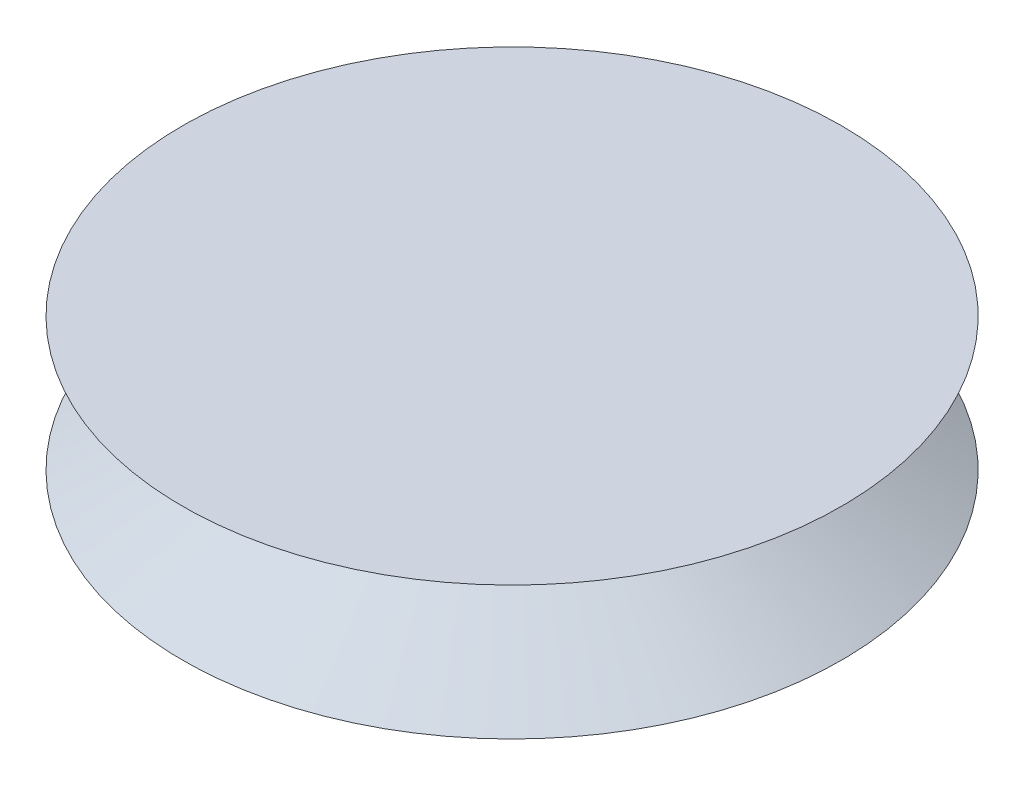
ISO-10303-21;
HEADER;
FILE_DESCRIPTION(('STEP AP214'),'2;1');
FILE_NAME('part.step','',(''),(''),'','','');
FILE_SCHEMA(('AUTOMOTIVE_DESIGN { 1 0 10303 214 1 1 1 1 }'));
ENDSEC;
DATA;
#1=APPLICATION_CONTEXT('core data for automotive mechanical design processes');
#2=APPLICATION_PROTOCOL_DEFINITION('international standard','automotive_design',2000,#1);
#3=PRODUCT_CONTEXT('',#1,'mechanical');
#4=PRODUCT('Part','Part','',(#3));
#5=PRODUCT_RELATED_PRODUCT_CATEGORY('part','',(#4));
#6=PRODUCT_DEFINITION_FORMATION('','',#4);
#7=PRODUCT_DEFINITION_CONTEXT('part definition',#1,'design');
#8=PRODUCT_DEFINITION('design','',#6,#7);
#9=PRODUCT_DEFINITION_SHAPE('','',#8);
#10=(LENGTH_UNIT() NAMED_UNIT(*) SI_UNIT(.MILLI.,.METRE.));
#11=(NAMED_UNIT(*) PLANE_ANGLE_UNIT() SI_UNIT($,.RADIAN.));
#12=(NAMED_UNIT(*) SI_UNIT($,.STERADIAN.) SOLID_ANGLE_UNIT());
#13=UNCERTAINTY_MEASURE_WITH_UNIT(LENGTH_MEASURE(1.E-05),#10,'distance_accuracy_value','');
#14=(GEOMETRIC_REPRESENTATION_CONTEXT(3) GLOBAL_UNCERTAINTY_ASSIGNED_CONTEXT((#13)) GLOBAL_UNIT_ASSIGNED_CONTEXT((#10,
#11,#12)) REPRESENTATION_CONTEXT('',''));
#15=CARTESIAN_POINT('',(0.,0.,0.));
#16=DIRECTION('',(0.,0.,1.));
#17=DIRECTION('',(1.,0.,0.));
#18=AXIS2_PLACEMENT_3D('',#15,#16,#17);
#19=CARTESIAN_POINT('',(-68.9357898147831,63.2017306856585,0.));
#20=DIRECTION('',(0.,-1.,0.));
#21=DIRECTION('',(0.,0.,-1.));
#22=AXIS2_PLACEMENT_3D('',#19,#20,#21);
#23=CONICAL_SURFACE('',#22,38.2092999291395,1.03158309855684);
#24=CARTESIAN_POINT('',(-68.9357898147831,48.6742364417669,0.));
#25=DIRECTION('',(0.,-1.,0.));
#26=DIRECTION('',(0.,0.,-1.));
#27=AXIS2_PLACEMENT_3D('',#24,#25,#26);
#28=CIRCLE('',#27,62.4881259257802);
#29=CARTESIAN_POINT('',(-68.9357898147831,48.6742364417669,-62.4881259257802));
#30=VERTEX_POINT('',#29);
#31=EDGE_CURVE('E53',#30,#30,#28,.T.);
#32=ORIENTED_EDGE('',*,*,#31,.F.);
#33=EDGE_LOOP('',(#32));
#34=FACE_BOUND('',#33,.T.);
#35=CARTESIAN_POINT('',(-68.9357898147831,63.2017306856585,0.));
#36=DIRECTION('',(0.,-1.,0.));
#37=DIRECTION('',(0.,0.,-1.));
#38=AXIS2_PLACEMENT_3D('',#35,#36,#37);
#39=CIRCLE('',#38,38.2092999291395);
#40=CARTESIAN_POINT('',(-68.9357898147831,63.2017306856585,-38.2092999291395));
#41=VERTEX_POINT('',#40);
#42=EDGE_CURVE('E10',#41,#41,#39,.T.);
#43=ORIENTED_EDGE('',*,*,#42,.T.);
#44=EDGE_LOOP('',(#43));
#45=FACE_BOUND('',#44,.T.);
#46=ADVANCED_FACE('F41',(#34,#45),#23,.T.);
#47=CARTESIAN_POINT('',(-68.9357898147831,73.948096290729,0.));
#48=DIRECTION('',(0.,1.,0.));
#49=DIRECTION('',(0.,0.,1.));
#50=AXIS2_PLACEMENT_3D('',#47,#48,#49);
#51=CONICAL_SURFACE('',#50,62.4881259257802,1.1540940660555);
#52=ORIENTED_EDGE('',*,*,#42,.F.);
#53=EDGE_LOOP('',(#52));
#54=FACE_BOUND('',#53,.T.);
#55=CARTESIAN_POINT('',(-68.9357898147831,73.948096290729,0.));
#56=DIRECTION('',(0.,-1.,0.));
#57=DIRECTION('',(0.,0.,-1.));
#58=AXIS2_PLACEMENT_3D('',#55,#56,#57);
#59=CIRCLE('',#58,62.4881259257802);
#60=CARTESIAN_POINT('',(-68.9357898147831,73.948096290729,-62.4881259257802));
#61=VERTEX_POINT('',#60);
#62=EDGE_CURVE('E48',#61,#61,#59,.T.);
#63=ORIENTED_EDGE('',*,*,#62,.T.);
#64=EDGE_LOOP('',(#63));
#65=FACE_BOUND('',#64,.T.);
#66=ADVANCED_FACE('F64',(#54,#65),#51,.T.);
#67=CARTESIAN_POINT('',(-68.9357898147831,73.948096290729,0.));
#68=DIRECTION('',(0.,-1.,0.));
#69=DIRECTION('',(0.,0.,-1.));
#70=AXIS2_PLACEMENT_3D('',#67,#68,#69);
#71=PLANE('',#70);
#72=ORIENTED_EDGE('',*,*,#62,.F.);
#73=EDGE_LOOP('',(#72));
#74=FACE_BOUND('',#73,.T.);
#75=ADVANCED_FACE('F68',(#74),#71,.F.);
#76=CARTESIAN_POINT('',(-131.423915740563,48.6742364417669,0.));
#77=DIRECTION('',(0.,1.,0.));
#78=DIRECTION('',(0.,0.,1.));
#79=AXIS2_PLACEMENT_3D('',#76,#77,#78);
#80=PLANE('',#79);
#81=ORIENTED_EDGE('',*,*,#31,.T.);
#82=EDGE_LOOP('',(#81));
#83=FACE_BOUND('',#82,.T.);
#84=ADVANCED_FACE('F61',(#83),#80,.F.);
#85=CLOSED_SHELL('',(#46,#66,#75,#84));
#86=MANIFOLD_SOLID_BREP('B2',#85);
#87=ADVANCED_BREP_SHAPE_REPRESENTATION('',(#18,#86),#14);
#88=SHAPE_DEFINITION_REPRESENTATION(#9,#87);
ENDSEC;
END-ISO-10303-21;
